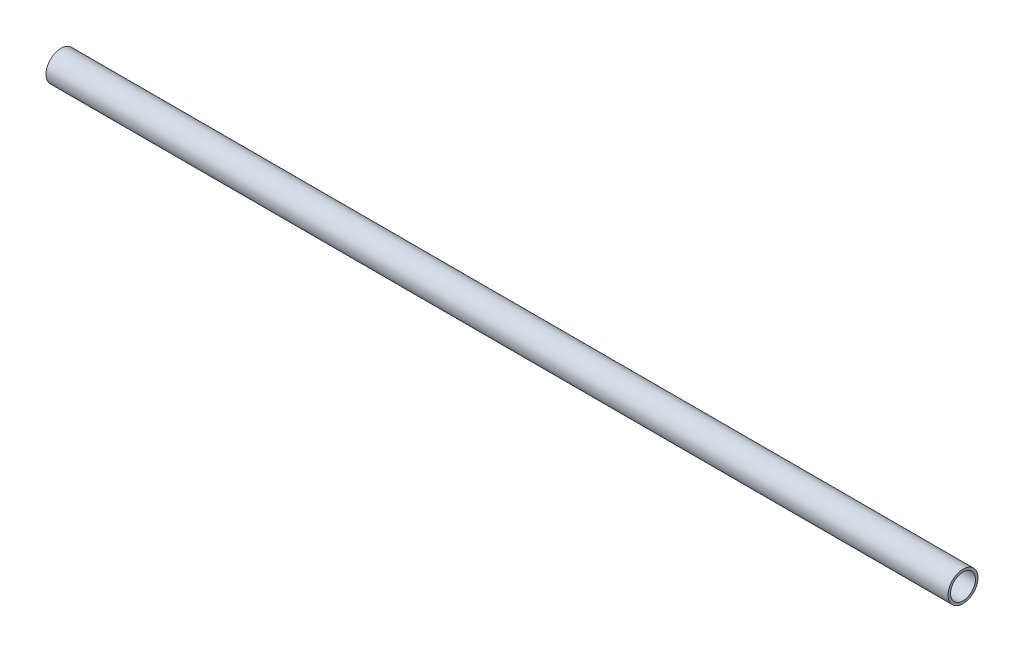
ISO-10303-21;
HEADER;
FILE_DESCRIPTION(('STEP AP214'),'2;1');
FILE_NAME('part.step','',(''),(''),'','','');
FILE_SCHEMA(('AUTOMOTIVE_DESIGN { 1 0 10303 214 1 1 1 1 }'));
ENDSEC;
DATA;
#1=APPLICATION_CONTEXT('core data for automotive mechanical design processes');
#2=APPLICATION_PROTOCOL_DEFINITION('international standard','automotive_design',2000,#1);
#3=PRODUCT_CONTEXT('',#1,'mechanical');
#4=PRODUCT('Part','Part','',(#3));
#5=PRODUCT_RELATED_PRODUCT_CATEGORY('part','',(#4));
#6=PRODUCT_DEFINITION_FORMATION('','',#4);
#7=PRODUCT_DEFINITION_CONTEXT('part definition',#1,'design');
#8=PRODUCT_DEFINITION('design','',#6,#7);
#9=PRODUCT_DEFINITION_SHAPE('','',#8);
#10=(LENGTH_UNIT() NAMED_UNIT(*) SI_UNIT(.MILLI.,.METRE.));
#11=(NAMED_UNIT(*) PLANE_ANGLE_UNIT() SI_UNIT($,.RADIAN.));
#12=(NAMED_UNIT(*) SI_UNIT($,.STERADIAN.) SOLID_ANGLE_UNIT());
#13=UNCERTAINTY_MEASURE_WITH_UNIT(LENGTH_MEASURE(1.E-05),#10,'distance_accuracy_value','');
#14=(GEOMETRIC_REPRESENTATION_CONTEXT(3) GLOBAL_UNCERTAINTY_ASSIGNED_CONTEXT((#13)) GLOBAL_UNIT_ASSIGNED_CONTEXT((#10,
#11,#12)) REPRESENTATION_CONTEXT('',''));
#15=CARTESIAN_POINT('',(0.,0.,0.));
#16=DIRECTION('',(0.,0.,1.));
#17=DIRECTION('',(1.,0.,0.));
#18=AXIS2_PLACEMENT_3D('',#15,#16,#17);
#19=CARTESIAN_POINT('',(-635.,0.,0.));
#20=DIRECTION('',(1.,0.,0.));
#21=DIRECTION('',(0.,0.,-1.));
#22=AXIS2_PLACEMENT_3D('',#19,#20,#21);
#23=CYLINDRICAL_SURFACE('',#22,17.526);
#24=CARTESIAN_POINT('',(635.,0.,0.));
#25=DIRECTION('',(1.,0.,0.));
#26=DIRECTION('',(0.,0.,-1.));
#27=AXIS2_PLACEMENT_3D('',#24,#25,#26);
#28=CIRCLE('',#27,17.526);
#29=CARTESIAN_POINT('',(635.,0.,-17.526));
#30=VERTEX_POINT('',#29);
#31=EDGE_CURVE('E18',#30,#30,#28,.F.);
#32=ORIENTED_EDGE('',*,*,#31,.F.);
#33=EDGE_LOOP('',(#32));
#34=FACE_BOUND('',#33,.T.);
#35=CARTESIAN_POINT('',(-635.,0.,0.));
#36=DIRECTION('',(1.,0.,0.));
#37=DIRECTION('',(0.,0.,-1.));
#38=AXIS2_PLACEMENT_3D('',#35,#36,#37);
#39=CIRCLE('',#38,17.526);
#40=CARTESIAN_POINT('',(-635.,0.,-17.526));
#41=VERTEX_POINT('',#40);
#42=EDGE_CURVE('E27',#41,#41,#39,.F.);
#43=ORIENTED_EDGE('',*,*,#42,.T.);
#44=EDGE_LOOP('',(#43));
#45=FACE_BOUND('',#44,.T.);
#46=ADVANCED_FACE('F15',(#34,#45),#23,.F.);
#47=CARTESIAN_POINT('',(635.,0.,0.));
#48=DIRECTION('',(1.,0.,0.));
#49=DIRECTION('',(0.,0.,-1.));
#50=AXIS2_PLACEMENT_3D('',#47,#48,#49);
#51=PLANE('',#50);
#52=ORIENTED_EDGE('',*,*,#31,.T.);
#53=EDGE_LOOP('',(#52));
#54=FACE_BOUND('',#53,.T.);
#55=CARTESIAN_POINT('',(635.,0.,0.));
#56=DIRECTION('',(1.,0.,0.));
#57=DIRECTION('',(0.,0.,-1.));
#58=AXIS2_PLACEMENT_3D('',#55,#56,#57);
#59=CIRCLE('',#58,21.082);
#60=CARTESIAN_POINT('',(635.,0.,-21.082));
#61=VERTEX_POINT('',#60);
#62=EDGE_CURVE('E22',#61,#61,#59,.F.);
#63=ORIENTED_EDGE('',*,*,#62,.F.);
#64=EDGE_LOOP('',(#63));
#65=FACE_BOUND('',#64,.T.);
#66=ADVANCED_FACE('F35',(#54,#65),#51,.T.);
#67=CARTESIAN_POINT('',(-635.,0.,0.));
#68=DIRECTION('',(1.,0.,0.));
#69=DIRECTION('',(0.,0.,-1.));
#70=AXIS2_PLACEMENT_3D('',#67,#68,#69);
#71=PLANE('',#70);
#72=ORIENTED_EDGE('',*,*,#42,.F.);
#73=EDGE_LOOP('',(#72));
#74=FACE_BOUND('',#73,.T.);
#75=CARTESIAN_POINT('',(-635.,0.,0.));
#76=DIRECTION('',(1.,0.,0.));
#77=DIRECTION('',(0.,0.,-1.));
#78=AXIS2_PLACEMENT_3D('',#75,#76,#77);
#79=CIRCLE('',#78,21.082);
#80=CARTESIAN_POINT('',(-635.,0.,-21.082));
#81=VERTEX_POINT('',#80);
#82=EDGE_CURVE('E10',#81,#81,#79,.T.);
#83=ORIENTED_EDGE('',*,*,#82,.F.);
#84=EDGE_LOOP('',(#83));
#85=FACE_BOUND('',#84,.T.);
#86=ADVANCED_FACE('F43',(#74,#85),#71,.F.);
#87=CARTESIAN_POINT('',(-635.,0.,0.));
#88=DIRECTION('',(1.,0.,0.));
#89=DIRECTION('',(0.,0.,-1.));
#90=AXIS2_PLACEMENT_3D('',#87,#88,#89);
#91=CYLINDRICAL_SURFACE('',#90,21.082);
#92=ORIENTED_EDGE('',*,*,#62,.T.);
#93=EDGE_LOOP('',(#92));
#94=FACE_BOUND('',#93,.T.);
#95=ORIENTED_EDGE('',*,*,#82,.T.);
#96=EDGE_LOOP('',(#95));
#97=FACE_BOUND('',#96,.T.);
#98=ADVANCED_FACE('F44',(#94,#97),#91,.T.);
#99=CLOSED_SHELL('',(#46,#66,#86,#98));
#100=MANIFOLD_SOLID_BREP('B1',#99);
#101=ADVANCED_BREP_SHAPE_REPRESENTATION('',(#18,#100),#14);
#102=SHAPE_DEFINITION_REPRESENTATION(#9,#101);
ENDSEC;
END-ISO-10303-21;
